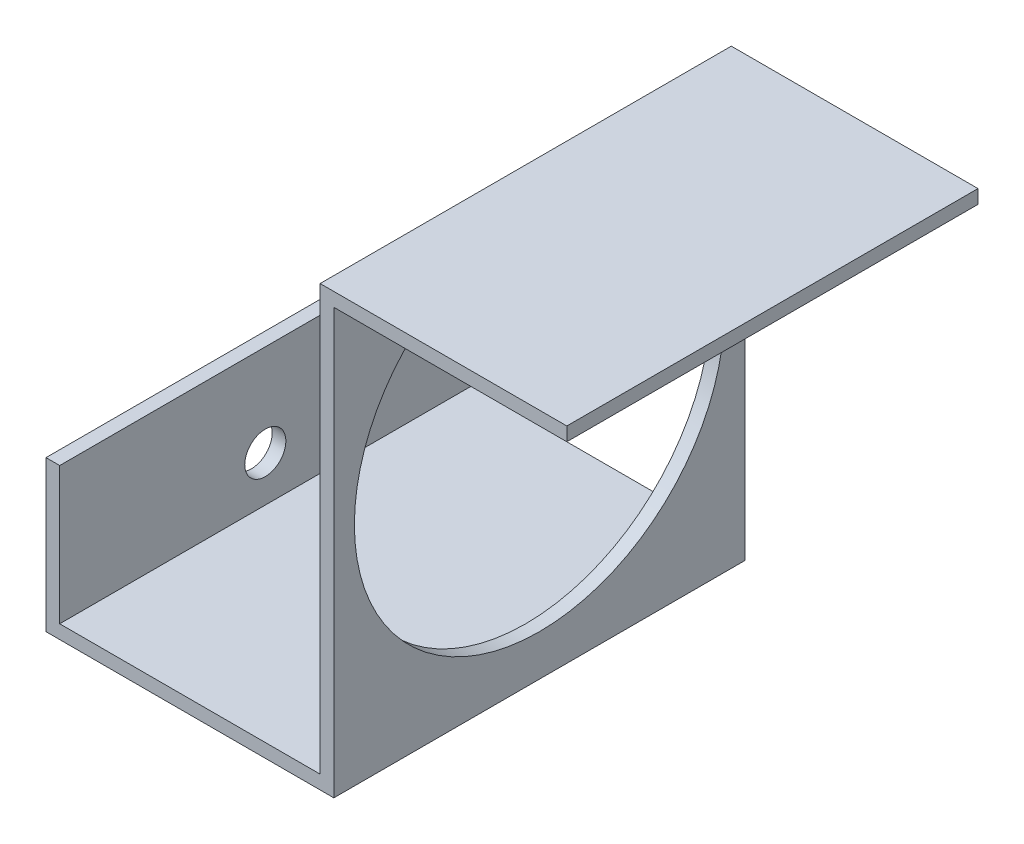
ISO-10303-21;
HEADER;
FILE_DESCRIPTION(('STEP AP214'),'2;1');
FILE_NAME('part.step','',(''),(''),'','','');
FILE_SCHEMA(('AUTOMOTIVE_DESIGN { 1 0 10303 214 1 1 1 1 }'));
ENDSEC;
DATA;
#1=APPLICATION_CONTEXT('core data for automotive mechanical design processes');
#2=APPLICATION_PROTOCOL_DEFINITION('international standard','automotive_design',2000,#1);
#3=PRODUCT_CONTEXT('',#1,'mechanical');
#4=PRODUCT('Part','Part','',(#3));
#5=PRODUCT_RELATED_PRODUCT_CATEGORY('part','',(#4));
#6=PRODUCT_DEFINITION_FORMATION('','',#4);
#7=PRODUCT_DEFINITION_CONTEXT('part definition',#1,'design');
#8=PRODUCT_DEFINITION('design','',#6,#7);
#9=PRODUCT_DEFINITION_SHAPE('','',#8);
#10=(LENGTH_UNIT() NAMED_UNIT(*) SI_UNIT(.MILLI.,.METRE.));
#11=(NAMED_UNIT(*) PLANE_ANGLE_UNIT() SI_UNIT($,.RADIAN.));
#12=(NAMED_UNIT(*) SI_UNIT($,.STERADIAN.) SOLID_ANGLE_UNIT());
#13=UNCERTAINTY_MEASURE_WITH_UNIT(LENGTH_MEASURE(1.E-05),#10,'distance_accuracy_value','');
#14=(GEOMETRIC_REPRESENTATION_CONTEXT(3) GLOBAL_UNCERTAINTY_ASSIGNED_CONTEXT((#13)) GLOBAL_UNIT_ASSIGNED_CONTEXT((#10,
#11,#12)) REPRESENTATION_CONTEXT('',''));
#15=CARTESIAN_POINT('',(0.,0.,0.));
#16=DIRECTION('',(0.,0.,1.));
#17=DIRECTION('',(1.,0.,0.));
#18=AXIS2_PLACEMENT_3D('',#15,#16,#17);
#19=CARTESIAN_POINT('',(-22.1673404424638,37.6728261446231,30.));
#20=DIRECTION('',(0.,-1.,0.));
#21=DIRECTION('',(0.,0.,-1.));
#22=AXIS2_PLACEMENT_3D('',#19,#20,#21);
#23=PLANE('',#22);
#24=DIRECTION('',(-1.,0.,0.));
#25=VECTOR('',#24,1.);
#26=CARTESIAN_POINT('',(-22.1673404424638,37.6728261446231,0.));
#27=LINE('',#26,#25);
#28=CARTESIAN_POINT('',(-21.1673404424638,37.6728261446231,0.));
#29=VERTEX_POINT('',#28);
#30=CARTESIAN_POINT('',(-22.1673404424638,37.6728261446231,0.));
#31=VERTEX_POINT('',#30);
#32=EDGE_CURVE('E144',#29,#31,#27,.T.);
#33=ORIENTED_EDGE('',*,*,#32,.T.);
#34=DIRECTION('',(0.,0.,-1.));
#35=VECTOR('',#34,1.);
#36=CARTESIAN_POINT('',(-22.1673404424638,37.6728261446231,30.));
#37=LINE('',#36,#35);
#38=CARTESIAN_POINT('',(-22.1673404424638,37.6728261446231,30.));
#39=VERTEX_POINT('',#38);
#40=EDGE_CURVE('E11',#39,#31,#37,.T.);
#41=ORIENTED_EDGE('',*,*,#40,.F.);
#42=DIRECTION('',(-1.,0.,0.));
#43=VECTOR('',#42,1.);
#44=CARTESIAN_POINT('',(-22.1673404424638,37.6728261446231,30.));
#45=LINE('',#44,#43);
#46=CARTESIAN_POINT('',(-21.1673404424638,37.6728261446231,30.));
#47=VERTEX_POINT('',#46);
#48=EDGE_CURVE('E162',#47,#39,#45,.T.);
#49=ORIENTED_EDGE('',*,*,#48,.F.);
#50=DIRECTION('',(0.,0.,-1.));
#51=VECTOR('',#50,1.);
#52=CARTESIAN_POINT('',(-21.1673404424638,37.6728261446231,30.));
#53=LINE('',#52,#51);
#54=EDGE_CURVE('E140',#47,#29,#53,.T.);
#55=ORIENTED_EDGE('',*,*,#54,.T.);
#56=EDGE_LOOP('',(#33,#41,#49,#55));
#57=FACE_BOUND('',#56,.T.);
#58=ADVANCED_FACE('F35',(#57),#23,.F.);
#59=CARTESIAN_POINT('',(-22.1673404424638,26.6728261446231,30.));
#60=DIRECTION('',(1.,0.,0.));
#61=DIRECTION('',(0.,0.,-1.));
#62=AXIS2_PLACEMENT_3D('',#59,#60,#61);
#63=PLANE('',#62);
#64=CARTESIAN_POINT('',(-22.1673404424638,30.9728261446231,15.));
#65=DIRECTION('',(-1.,0.,0.));
#66=DIRECTION('',(0.,0.,1.));
#67=AXIS2_PLACEMENT_3D('',#64,#65,#66);
#68=CIRCLE('',#67,1.5);
#69=CARTESIAN_POINT('',(-22.1673404424638,30.9728261446231,16.5));
#70=VERTEX_POINT('',#69);
#71=EDGE_CURVE('E210',#70,#70,#68,.T.);
#72=ORIENTED_EDGE('',*,*,#71,.F.);
#73=EDGE_LOOP('',(#72));
#74=FACE_BOUND('',#73,.T.);
#75=DIRECTION('',(0.,-1.,0.));
#76=VECTOR('',#75,1.);
#77=CARTESIAN_POINT('',(-22.1673404424638,26.6728261446231,0.));
#78=LINE('',#77,#76);
#79=CARTESIAN_POINT('',(-22.1673404424638,26.6728261446231,0.));
#80=VERTEX_POINT('',#79);
#81=EDGE_CURVE('E147',#31,#80,#78,.T.);
#82=ORIENTED_EDGE('',*,*,#81,.T.);
#83=DIRECTION('',(0.,0.,-1.));
#84=VECTOR('',#83,1.);
#85=CARTESIAN_POINT('',(-22.1673404424638,26.6728261446231,30.));
#86=LINE('',#85,#84);
#87=CARTESIAN_POINT('',(-22.1673404424638,26.6728261446231,30.));
#88=VERTEX_POINT('',#87);
#89=EDGE_CURVE('E44',#88,#80,#86,.T.);
#90=ORIENTED_EDGE('',*,*,#89,.F.);
#91=DIRECTION('',(0.,-1.,0.));
#92=VECTOR('',#91,1.);
#93=CARTESIAN_POINT('',(-22.1673404424638,26.6728261446231,30.));
#94=LINE('',#93,#92);
#95=EDGE_CURVE('E101',#39,#88,#94,.T.);
#96=ORIENTED_EDGE('',*,*,#95,.F.);
#97=ORIENTED_EDGE('',*,*,#40,.T.);
#98=EDGE_LOOP('',(#82,#90,#96,#97));
#99=FACE_BOUND('',#98,.T.);
#100=ADVANCED_FACE('F236',(#74,#99),#63,.F.);
#101=CARTESIAN_POINT('',(-1.16734044246379,26.6728261446231,30.));
#102=DIRECTION('',(0.,1.,0.));
#103=DIRECTION('',(-1.,0.,0.));
#104=AXIS2_PLACEMENT_3D('',#101,#102,#103);
#105=PLANE('',#104);
#106=DIRECTION('',(1.,0.,0.));
#107=VECTOR('',#106,1.);
#108=CARTESIAN_POINT('',(-1.16734044246379,26.6728261446231,0.));
#109=LINE('',#108,#107);
#110=CARTESIAN_POINT('',(-1.16734044246379,26.6728261446231,0.));
#111=VERTEX_POINT('',#110);
#112=EDGE_CURVE('E149',#80,#111,#109,.T.);
#113=ORIENTED_EDGE('',*,*,#112,.T.);
#114=DIRECTION('',(0.,0.,-1.));
#115=VECTOR('',#114,1.);
#116=CARTESIAN_POINT('',(-1.16734044246379,26.6728261446231,30.));
#117=LINE('',#116,#115);
#118=CARTESIAN_POINT('',(-1.16734044246379,26.6728261446231,30.));
#119=VERTEX_POINT('',#118);
#120=EDGE_CURVE('E175',#119,#111,#117,.T.);
#121=ORIENTED_EDGE('',*,*,#120,.F.);
#122=DIRECTION('',(1.,0.,0.));
#123=VECTOR('',#122,1.);
#124=CARTESIAN_POINT('',(-1.16734044246379,26.6728261446231,30.));
#125=LINE('',#124,#123);
#126=EDGE_CURVE('E184',#88,#119,#125,.T.);
#127=ORIENTED_EDGE('',*,*,#126,.F.);
#128=ORIENTED_EDGE('',*,*,#89,.T.);
#129=EDGE_LOOP('',(#113,#121,#127,#128));
#130=FACE_BOUND('',#129,.T.);
#131=ADVANCED_FACE('F182',(#130),#105,.F.);
#132=CARTESIAN_POINT('',(-1.1673404424638,57.6728261446231,30.));
#133=DIRECTION('',(-1.,0.,0.));
#134=DIRECTION('',(0.,-1.,0.));
#135=AXIS2_PLACEMENT_3D('',#132,#133,#134);
#136=PLANE('',#135);
#137=CARTESIAN_POINT('',(-1.16734044246379,43.1728261446231,15.));
#138=DIRECTION('',(-1.,0.,0.));
#139=DIRECTION('',(0.,-1.,0.));
#140=AXIS2_PLACEMENT_3D('',#137,#138,#139);
#141=CIRCLE('',#140,13.5);
#142=CARTESIAN_POINT('',(-1.16734044246379,29.6728261446231,15.));
#143=VERTEX_POINT('',#142);
#144=EDGE_CURVE('E213',#143,#143,#141,.T.);
#145=ORIENTED_EDGE('',*,*,#144,.T.);
#146=EDGE_LOOP('',(#145));
#147=FACE_BOUND('',#146,.T.);
#148=DIRECTION('',(0.,1.,0.));
#149=VECTOR('',#148,1.);
#150=CARTESIAN_POINT('',(-1.1673404424638,57.6728261446231,0.));
#151=LINE('',#150,#149);
#152=CARTESIAN_POINT('',(-1.1673404424638,57.6728261446231,0.));
#153=VERTEX_POINT('',#152);
#154=EDGE_CURVE('E151',#111,#153,#151,.T.);
#155=ORIENTED_EDGE('',*,*,#154,.T.);
#156=DIRECTION('',(0.,0.,-1.));
#157=VECTOR('',#156,1.);
#158=CARTESIAN_POINT('',(-1.1673404424638,57.6728261446231,30.));
#159=LINE('',#158,#157);
#160=CARTESIAN_POINT('',(-1.1673404424638,57.6728261446231,30.));
#161=VERTEX_POINT('',#160);
#162=EDGE_CURVE('E172',#161,#153,#159,.T.);
#163=ORIENTED_EDGE('',*,*,#162,.F.);
#164=DIRECTION('',(0.,1.,0.));
#165=VECTOR('',#164,1.);
#166=CARTESIAN_POINT('',(-1.1673404424638,57.6728261446231,30.));
#167=LINE('',#166,#165);
#168=EDGE_CURVE('E202',#119,#161,#167,.T.);
#169=ORIENTED_EDGE('',*,*,#168,.F.);
#170=ORIENTED_EDGE('',*,*,#120,.T.);
#171=EDGE_LOOP('',(#155,#163,#169,#170));
#172=FACE_BOUND('',#171,.T.);
#173=ADVANCED_FACE('F193',(#147,#172),#136,.F.);
#174=CARTESIAN_POINT('',(-1.1673404424638,57.6728261446231,30.));
#175=DIRECTION('',(0.,1.,0.));
#176=DIRECTION('',(0.,0.,1.));
#177=AXIS2_PLACEMENT_3D('',#174,#175,#176);
#178=PLANE('',#177);
#179=DIRECTION('',(1.,0.,0.));
#180=VECTOR('',#179,1.);
#181=CARTESIAN_POINT('',(-1.1673404424638,57.6728261446231,0.));
#182=LINE('',#181,#180);
#183=CARTESIAN_POINT('',(15.8326595575362,57.6728261446231,0.));
#184=VERTEX_POINT('',#183);
#185=EDGE_CURVE('E153',#153,#184,#182,.T.);
#186=ORIENTED_EDGE('',*,*,#185,.T.);
#187=DIRECTION('',(0.,0.,-1.));
#188=VECTOR('',#187,1.);
#189=CARTESIAN_POINT('',(15.8326595575362,57.6728261446231,30.));
#190=LINE('',#189,#188);
#191=CARTESIAN_POINT('',(15.8326595575362,57.6728261446231,30.));
#192=VERTEX_POINT('',#191);
#193=EDGE_CURVE('E169',#192,#184,#190,.T.);
#194=ORIENTED_EDGE('',*,*,#193,.F.);
#195=DIRECTION('',(1.,0.,0.));
#196=VECTOR('',#195,1.);
#197=CARTESIAN_POINT('',(-1.1673404424638,57.6728261446231,30.));
#198=LINE('',#197,#196);
#199=EDGE_CURVE('E199',#161,#192,#198,.T.);
#200=ORIENTED_EDGE('',*,*,#199,.F.);
#201=ORIENTED_EDGE('',*,*,#162,.T.);
#202=EDGE_LOOP('',(#186,#194,#200,#201));
#203=FACE_BOUND('',#202,.T.);
#204=ADVANCED_FACE('F197',(#203),#178,.F.);
#205=CARTESIAN_POINT('',(15.8326595575362,57.6728261446231,30.));
#206=DIRECTION('',(-1.,0.,0.));
#207=DIRECTION('',(0.,0.,1.));
#208=AXIS2_PLACEMENT_3D('',#205,#206,#207);
#209=PLANE('',#208);
#210=DIRECTION('',(0.,1.,0.));
#211=VECTOR('',#210,1.);
#212=CARTESIAN_POINT('',(15.8326595575362,57.6728261446231,0.));
#213=LINE('',#212,#211);
#214=CARTESIAN_POINT('',(15.8326595575362,58.6728261446231,0.));
#215=VERTEX_POINT('',#214);
#216=EDGE_CURVE('E155',#184,#215,#213,.T.);
#217=ORIENTED_EDGE('',*,*,#216,.T.);
#218=DIRECTION('',(0.,0.,-1.));
#219=VECTOR('',#218,1.);
#220=CARTESIAN_POINT('',(15.8326595575362,58.6728261446231,30.));
#221=LINE('',#220,#219);
#222=CARTESIAN_POINT('',(15.8326595575362,58.6728261446231,30.));
#223=VERTEX_POINT('',#222);
#224=EDGE_CURVE('E166',#223,#215,#221,.T.);
#225=ORIENTED_EDGE('',*,*,#224,.F.);
#226=DIRECTION('',(0.,1.,0.));
#227=VECTOR('',#226,1.);
#228=CARTESIAN_POINT('',(15.8326595575362,57.6728261446231,30.));
#229=LINE('',#228,#227);
#230=EDGE_CURVE('E201',#192,#223,#229,.T.);
#231=ORIENTED_EDGE('',*,*,#230,.F.);
#232=ORIENTED_EDGE('',*,*,#193,.T.);
#233=EDGE_LOOP('',(#217,#225,#231,#232));
#234=FACE_BOUND('',#233,.T.);
#235=ADVANCED_FACE('F232',(#234),#209,.F.);
#236=CARTESIAN_POINT('',(15.8326595575362,58.6728261446231,30.));
#237=DIRECTION('',(0.,-1.,0.));
#238=DIRECTION('',(0.,0.,-1.));
#239=AXIS2_PLACEMENT_3D('',#236,#237,#238);
#240=PLANE('',#239);
#241=DIRECTION('',(-1.,0.,0.));
#242=VECTOR('',#241,1.);
#243=CARTESIAN_POINT('',(15.8326595575362,58.6728261446231,0.));
#244=LINE('',#243,#242);
#245=CARTESIAN_POINT('',(-2.1673404424638,58.6728261446231,0.));
#246=VERTEX_POINT('',#245);
#247=EDGE_CURVE('E157',#215,#246,#244,.T.);
#248=ORIENTED_EDGE('',*,*,#247,.T.);
#249=DIRECTION('',(0.,0.,-1.));
#250=VECTOR('',#249,1.);
#251=CARTESIAN_POINT('',(-2.1673404424638,58.6728261446231,30.));
#252=LINE('',#251,#250);
#253=CARTESIAN_POINT('',(-2.1673404424638,58.6728261446231,30.));
#254=VERTEX_POINT('',#253);
#255=EDGE_CURVE('E135',#254,#246,#252,.T.);
#256=ORIENTED_EDGE('',*,*,#255,.F.);
#257=DIRECTION('',(-1.,0.,0.));
#258=VECTOR('',#257,1.);
#259=CARTESIAN_POINT('',(15.8326595575362,58.6728261446231,30.));
#260=LINE('',#259,#258);
#261=EDGE_CURVE('E126',#223,#254,#260,.T.);
#262=ORIENTED_EDGE('',*,*,#261,.F.);
#263=ORIENTED_EDGE('',*,*,#224,.T.);
#264=EDGE_LOOP('',(#248,#256,#262,#263));
#265=FACE_BOUND('',#264,.T.);
#266=ADVANCED_FACE('F224',(#265),#240,.F.);
#267=CARTESIAN_POINT('',(-2.1673404424638,58.6728261446231,30.));
#268=DIRECTION('',(1.,0.,0.));
#269=DIRECTION('',(0.,1.,0.));
#270=AXIS2_PLACEMENT_3D('',#267,#268,#269);
#271=PLANE('',#270);
#272=CARTESIAN_POINT('',(-2.16734044246379,43.1728261446231,15.));
#273=DIRECTION('',(-1.,0.,0.));
#274=DIRECTION('',(0.,-1.,0.));
#275=AXIS2_PLACEMENT_3D('',#272,#273,#274);
#276=CIRCLE('',#275,13.5);
#277=CARTESIAN_POINT('',(-2.16734044246379,29.6728261446231,15.));
#278=VERTEX_POINT('',#277);
#279=EDGE_CURVE('E216',#278,#278,#276,.T.);
#280=ORIENTED_EDGE('',*,*,#279,.F.);
#281=EDGE_LOOP('',(#280));
#282=FACE_BOUND('',#281,.T.);
#283=DIRECTION('',(0.,-1.,0.));
#284=VECTOR('',#283,1.);
#285=CARTESIAN_POINT('',(-2.1673404424638,58.6728261446231,0.));
#286=LINE('',#285,#284);
#287=CARTESIAN_POINT('',(-2.16734044246379,27.6728261446231,0.));
#288=VERTEX_POINT('',#287);
#289=EDGE_CURVE('E134',#246,#288,#286,.T.);
#290=ORIENTED_EDGE('',*,*,#289,.T.);
#291=DIRECTION('',(0.,0.,-1.));
#292=VECTOR('',#291,1.);
#293=CARTESIAN_POINT('',(-2.16734044246379,27.6728261446231,30.));
#294=LINE('',#293,#292);
#295=CARTESIAN_POINT('',(-2.16734044246379,27.6728261446231,30.));
#296=VERTEX_POINT('',#295);
#297=EDGE_CURVE('E131',#296,#288,#294,.T.);
#298=ORIENTED_EDGE('',*,*,#297,.F.);
#299=DIRECTION('',(0.,-1.,0.));
#300=VECTOR('',#299,1.);
#301=CARTESIAN_POINT('',(-2.1673404424638,58.6728261446231,30.));
#302=LINE('',#301,#300);
#303=EDGE_CURVE('E120',#254,#296,#302,.T.);
#304=ORIENTED_EDGE('',*,*,#303,.F.);
#305=ORIENTED_EDGE('',*,*,#255,.T.);
#306=EDGE_LOOP('',(#290,#298,#304,#305));
#307=FACE_BOUND('',#306,.T.);
#308=ADVANCED_FACE('F132',(#282,#307),#271,.F.);
#309=CARTESIAN_POINT('',(-21.1673404424638,27.6728261446231,30.));
#310=DIRECTION('',(0.,-1.,0.));
#311=DIRECTION('',(0.,0.,-1.));
#312=AXIS2_PLACEMENT_3D('',#309,#310,#311);
#313=PLANE('',#312);
#314=DIRECTION('',(-1.,0.,0.));
#315=VECTOR('',#314,1.);
#316=CARTESIAN_POINT('',(-21.1673404424638,27.6728261446231,0.));
#317=LINE('',#316,#315);
#318=CARTESIAN_POINT('',(-21.1673404424638,27.6728261446231,0.));
#319=VERTEX_POINT('',#318);
#320=EDGE_CURVE('E87',#288,#319,#317,.T.);
#321=ORIENTED_EDGE('',*,*,#320,.T.);
#322=DIRECTION('',(0.,0.,-1.));
#323=VECTOR('',#322,1.);
#324=CARTESIAN_POINT('',(-21.1673404424638,27.6728261446231,30.));
#325=LINE('',#324,#323);
#326=CARTESIAN_POINT('',(-21.1673404424638,27.6728261446231,30.));
#327=VERTEX_POINT('',#326);
#328=EDGE_CURVE('E136',#327,#319,#325,.T.);
#329=ORIENTED_EDGE('',*,*,#328,.F.);
#330=DIRECTION('',(-1.,0.,0.));
#331=VECTOR('',#330,1.);
#332=CARTESIAN_POINT('',(-21.1673404424638,27.6728261446231,30.));
#333=LINE('',#332,#331);
#334=EDGE_CURVE('E124',#296,#327,#333,.T.);
#335=ORIENTED_EDGE('',*,*,#334,.F.);
#336=ORIENTED_EDGE('',*,*,#297,.T.);
#337=EDGE_LOOP('',(#321,#329,#335,#336));
#338=FACE_BOUND('',#337,.T.);
#339=ADVANCED_FACE('F138',(#338),#313,.F.);
#340=CARTESIAN_POINT('',(-21.1673404424638,37.6728261446231,30.));
#341=DIRECTION('',(-1.,0.,0.));
#342=DIRECTION('',(0.,0.,1.));
#343=AXIS2_PLACEMENT_3D('',#340,#341,#342);
#344=PLANE('',#343);
#345=CARTESIAN_POINT('',(-21.1673404424638,30.9728261446231,15.));
#346=DIRECTION('',(-1.,0.,0.));
#347=DIRECTION('',(0.,0.,1.));
#348=AXIS2_PLACEMENT_3D('',#345,#346,#347);
#349=CIRCLE('',#348,1.5);
#350=CARTESIAN_POINT('',(-21.1673404424638,30.9728261446231,16.5));
#351=VERTEX_POINT('',#350);
#352=EDGE_CURVE('E38',#351,#351,#349,.T.);
#353=ORIENTED_EDGE('',*,*,#352,.T.);
#354=EDGE_LOOP('',(#353));
#355=FACE_BOUND('',#354,.T.);
#356=DIRECTION('',(0.,1.,0.));
#357=VECTOR('',#356,1.);
#358=CARTESIAN_POINT('',(-21.1673404424638,37.6728261446231,0.));
#359=LINE('',#358,#357);
#360=EDGE_CURVE('E93',#319,#29,#359,.T.);
#361=ORIENTED_EDGE('',*,*,#360,.T.);
#362=ORIENTED_EDGE('',*,*,#54,.F.);
#363=DIRECTION('',(0.,1.,0.));
#364=VECTOR('',#363,1.);
#365=CARTESIAN_POINT('',(-21.1673404424638,37.6728261446231,30.));
#366=LINE('',#365,#364);
#367=EDGE_CURVE('E52',#327,#47,#366,.T.);
#368=ORIENTED_EDGE('',*,*,#367,.F.);
#369=ORIENTED_EDGE('',*,*,#328,.T.);
#370=EDGE_LOOP('',(#361,#362,#368,#369));
#371=FACE_BOUND('',#370,.T.);
#372=ADVANCED_FACE('F230',(#355,#371),#344,.F.);
#373=CARTESIAN_POINT('',(0.,0.,30.));
#374=DIRECTION('',(0.,0.,-1.));
#375=DIRECTION('',(-1.,0.,0.));
#376=AXIS2_PLACEMENT_3D('',#373,#374,#375);
#377=PLANE('',#376);
#378=ORIENTED_EDGE('',*,*,#48,.T.);
#379=ORIENTED_EDGE('',*,*,#95,.T.);
#380=ORIENTED_EDGE('',*,*,#126,.T.);
#381=ORIENTED_EDGE('',*,*,#168,.T.);
#382=ORIENTED_EDGE('',*,*,#199,.T.);
#383=ORIENTED_EDGE('',*,*,#230,.T.);
#384=ORIENTED_EDGE('',*,*,#261,.T.);
#385=ORIENTED_EDGE('',*,*,#303,.T.);
#386=ORIENTED_EDGE('',*,*,#334,.T.);
#387=ORIENTED_EDGE('',*,*,#367,.T.);
#388=EDGE_LOOP('',(#378,#379,#380,#381,#382,#383,#384,#385,#386,#387));
#389=FACE_BOUND('',#388,.T.);
#390=ADVANCED_FACE('F122',(#389),#377,.F.);
#391=CARTESIAN_POINT('',(0.,0.,0.));
#392=DIRECTION('',(0.,0.,-1.));
#393=DIRECTION('',(-1.,0.,0.));
#394=AXIS2_PLACEMENT_3D('',#391,#392,#393);
#395=PLANE('',#394);
#396=ORIENTED_EDGE('',*,*,#32,.F.);
#397=ORIENTED_EDGE('',*,*,#360,.F.);
#398=ORIENTED_EDGE('',*,*,#320,.F.);
#399=ORIENTED_EDGE('',*,*,#289,.F.);
#400=ORIENTED_EDGE('',*,*,#247,.F.);
#401=ORIENTED_EDGE('',*,*,#216,.F.);
#402=ORIENTED_EDGE('',*,*,#185,.F.);
#403=ORIENTED_EDGE('',*,*,#154,.F.);
#404=ORIENTED_EDGE('',*,*,#112,.F.);
#405=ORIENTED_EDGE('',*,*,#81,.F.);
#406=EDGE_LOOP('',(#396,#397,#398,#399,#400,#401,#402,#403,#404,#405));
#407=FACE_BOUND('',#406,.T.);
#408=ADVANCED_FACE('F188',(#407),#395,.T.);
#409=CARTESIAN_POINT('',(-20.1673404424638,30.9728261446231,15.));
#410=DIRECTION('',(-1.,0.,0.));
#411=DIRECTION('',(0.,0.,1.));
#412=AXIS2_PLACEMENT_3D('',#409,#410,#411);
#413=CYLINDRICAL_SURFACE('',#412,1.5);
#414=ORIENTED_EDGE('',*,*,#71,.T.);
#415=EDGE_LOOP('',(#414));
#416=FACE_BOUND('',#415,.T.);
#417=ORIENTED_EDGE('',*,*,#352,.F.);
#418=EDGE_LOOP('',(#417));
#419=FACE_BOUND('',#418,.T.);
#420=ADVANCED_FACE('F306',(#416,#419),#413,.F.);
#421=CARTESIAN_POINT('',(2.83265955753621,43.1728261446231,15.));
#422=DIRECTION('',(-1.,0.,0.));
#423=DIRECTION('',(0.,-1.,0.));
#424=AXIS2_PLACEMENT_3D('',#421,#422,#423);
#425=CYLINDRICAL_SURFACE('',#424,13.5);
#426=ORIENTED_EDGE('',*,*,#279,.T.);
#427=EDGE_LOOP('',(#426));
#428=FACE_BOUND('',#427,.T.);
#429=ORIENTED_EDGE('',*,*,#144,.F.);
#430=EDGE_LOOP('',(#429));
#431=FACE_BOUND('',#430,.T.);
#432=ADVANCED_FACE('F220',(#428,#431),#425,.F.);
#433=CLOSED_SHELL('',(#58,#100,#131,#173,#204,#235,#266,#308,#339,#372,#390,#408,#420,#432));
#434=MANIFOLD_SOLID_BREP('B2',#433);
#435=ADVANCED_BREP_SHAPE_REPRESENTATION('',(#18,#434),#14);
#436=SHAPE_DEFINITION_REPRESENTATION(#9,#435);
ENDSEC;
END-ISO-10303-21;
